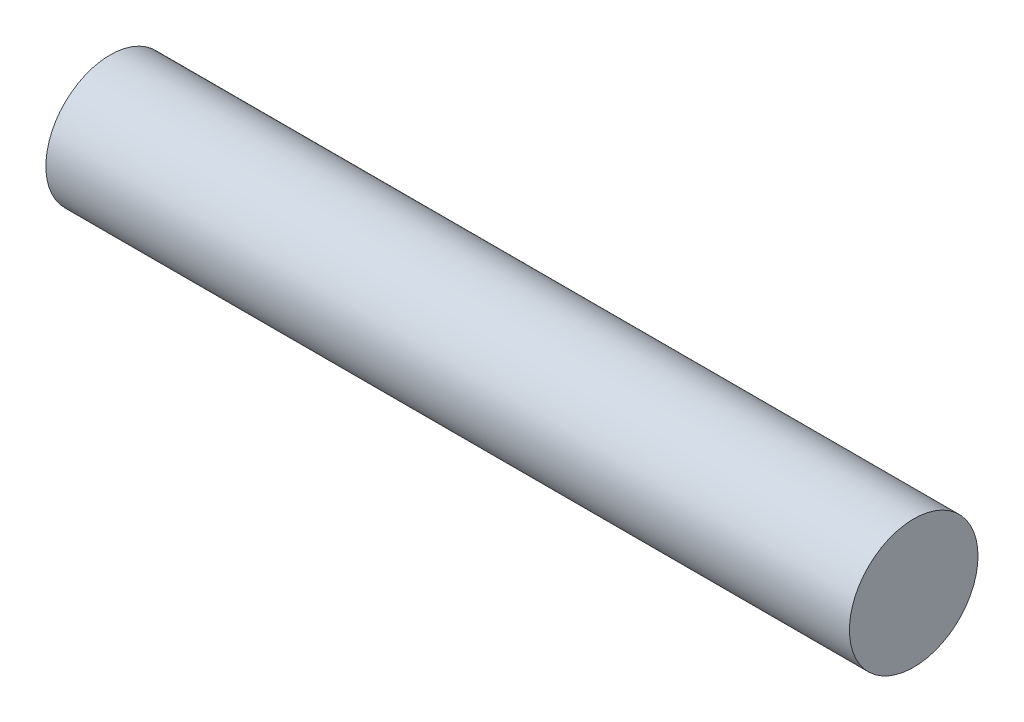
ISO-10303-21;
HEADER;
FILE_DESCRIPTION(('STEP AP214'),'2;1');
FILE_NAME('part.step','',(''),(''),'','','');
FILE_SCHEMA(('AUTOMOTIVE_DESIGN { 1 0 10303 214 1 1 1 1 }'));
ENDSEC;
DATA;
#1=APPLICATION_CONTEXT('core data for automotive mechanical design processes');
#2=APPLICATION_PROTOCOL_DEFINITION('international standard','automotive_design',2000,#1);
#3=PRODUCT_CONTEXT('',#1,'mechanical');
#4=PRODUCT('Part','Part','',(#3));
#5=PRODUCT_RELATED_PRODUCT_CATEGORY('part','',(#4));
#6=PRODUCT_DEFINITION_FORMATION('','',#4);
#7=PRODUCT_DEFINITION_CONTEXT('part definition',#1,'design');
#8=PRODUCT_DEFINITION('design','',#6,#7);
#9=PRODUCT_DEFINITION_SHAPE('','',#8);
#10=(LENGTH_UNIT() NAMED_UNIT(*) SI_UNIT(.MILLI.,.METRE.));
#11=(NAMED_UNIT(*) PLANE_ANGLE_UNIT() SI_UNIT($,.RADIAN.));
#12=(NAMED_UNIT(*) SI_UNIT($,.STERADIAN.) SOLID_ANGLE_UNIT());
#13=UNCERTAINTY_MEASURE_WITH_UNIT(LENGTH_MEASURE(1.E-05),#10,'distance_accuracy_value','');
#14=(GEOMETRIC_REPRESENTATION_CONTEXT(3) GLOBAL_UNCERTAINTY_ASSIGNED_CONTEXT((#13)) GLOBAL_UNIT_ASSIGNED_CONTEXT((#10,
#11,#12)) REPRESENTATION_CONTEXT('',''));
#15=CARTESIAN_POINT('',(0.,0.,0.));
#16=DIRECTION('',(0.,0.,1.));
#17=DIRECTION('',(1.,0.,0.));
#18=AXIS2_PLACEMENT_3D('',#15,#16,#17);
#19=CARTESIAN_POINT('',(158.75,0.,0.));
#20=DIRECTION('',(-1.,0.,0.));
#21=DIRECTION('',(0.,0.,1.));
#22=AXIS2_PLACEMENT_3D('',#19,#20,#21);
#23=CYLINDRICAL_SURFACE('',#22,12.7);
#24=CARTESIAN_POINT('',(158.75,0.,0.));
#25=DIRECTION('',(1.,0.,0.));
#26=DIRECTION('',(0.,0.,-1.));
#27=AXIS2_PLACEMENT_3D('',#24,#25,#26);
#28=CIRCLE('',#27,12.7);
#29=CARTESIAN_POINT('',(158.75,0.,-12.7));
#30=VERTEX_POINT('',#29);
#31=EDGE_CURVE('E10',#30,#30,#28,.T.);
#32=ORIENTED_EDGE('',*,*,#31,.F.);
#33=EDGE_LOOP('',(#32));
#34=FACE_BOUND('',#33,.T.);
#35=CARTESIAN_POINT('',(0.,0.,0.));
#36=DIRECTION('',(1.,0.,0.));
#37=DIRECTION('',(0.,0.,-1.));
#38=AXIS2_PLACEMENT_3D('',#35,#36,#37);
#39=CIRCLE('',#38,12.7);
#40=CARTESIAN_POINT('',(0.,0.,-12.7));
#41=VERTEX_POINT('',#40);
#42=EDGE_CURVE('E34',#41,#41,#39,.T.);
#43=ORIENTED_EDGE('',*,*,#42,.T.);
#44=EDGE_LOOP('',(#43));
#45=FACE_BOUND('',#44,.T.);
#46=ADVANCED_FACE('F31',(#34,#45),#23,.T.);
#47=CARTESIAN_POINT('',(158.75,0.,0.));
#48=DIRECTION('',(1.,0.,0.));
#49=DIRECTION('',(0.,0.,-1.));
#50=AXIS2_PLACEMENT_3D('',#47,#48,#49);
#51=PLANE('',#50);
#52=ORIENTED_EDGE('',*,*,#31,.T.);
#53=EDGE_LOOP('',(#52));
#54=FACE_BOUND('',#53,.T.);
#55=ADVANCED_FACE('F46',(#54),#51,.T.);
#56=CARTESIAN_POINT('',(0.,0.,0.));
#57=DIRECTION('',(1.,0.,0.));
#58=DIRECTION('',(0.,0.,-1.));
#59=AXIS2_PLACEMENT_3D('',#56,#57,#58);
#60=PLANE('',#59);
#61=ORIENTED_EDGE('',*,*,#42,.F.);
#62=EDGE_LOOP('',(#61));
#63=FACE_BOUND('',#62,.T.);
#64=ADVANCED_FACE('F44',(#63),#60,.F.);
#65=CLOSED_SHELL('',(#46,#55,#64));
#66=MANIFOLD_SOLID_BREP('B2',#65);
#67=ADVANCED_BREP_SHAPE_REPRESENTATION('',(#18,#66),#14);
#68=SHAPE_DEFINITION_REPRESENTATION(#9,#67);
ENDSEC;
END-ISO-10303-21;
